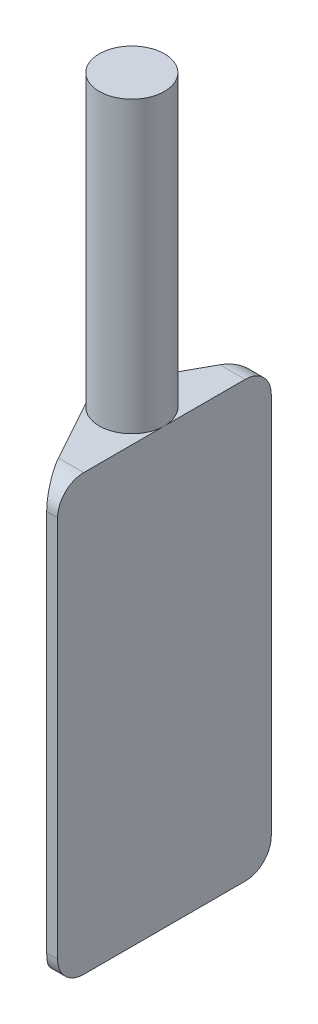
ISO-10303-21;
HEADER;
FILE_DESCRIPTION(('STEP AP214'),'2;1');
FILE_NAME('part.step','',(''),(''),'','','');
FILE_SCHEMA(('AUTOMOTIVE_DESIGN { 1 0 10303 214 1 1 1 1 }'));
ENDSEC;
DATA;
#1=APPLICATION_CONTEXT('core data for automotive mechanical design processes');
#2=APPLICATION_PROTOCOL_DEFINITION('international standard','automotive_design',2000,#1);
#3=PRODUCT_CONTEXT('',#1,'mechanical');
#4=PRODUCT('Part','Part','',(#3));
#5=PRODUCT_RELATED_PRODUCT_CATEGORY('part','',(#4));
#6=PRODUCT_DEFINITION_FORMATION('','',#4);
#7=PRODUCT_DEFINITION_CONTEXT('part definition',#1,'design');
#8=PRODUCT_DEFINITION('design','',#6,#7);
#9=PRODUCT_DEFINITION_SHAPE('','',#8);
#10=(LENGTH_UNIT() NAMED_UNIT(*) SI_UNIT(.MILLI.,.METRE.));
#11=(NAMED_UNIT(*) PLANE_ANGLE_UNIT() SI_UNIT($,.RADIAN.));
#12=(NAMED_UNIT(*) SI_UNIT($,.STERADIAN.) SOLID_ANGLE_UNIT());
#13=UNCERTAINTY_MEASURE_WITH_UNIT(LENGTH_MEASURE(1.E-05),#10,'distance_accuracy_value','');
#14=(GEOMETRIC_REPRESENTATION_CONTEXT(3) GLOBAL_UNCERTAINTY_ASSIGNED_CONTEXT((#13)) GLOBAL_UNIT_ASSIGNED_CONTEXT((#10,
#11,#12)) REPRESENTATION_CONTEXT('',''));
#15=CARTESIAN_POINT('',(0.,0.,0.));
#16=DIRECTION('',(0.,0.,1.));
#17=DIRECTION('',(1.,0.,0.));
#18=AXIS2_PLACEMENT_3D('',#15,#16,#17);
#19=CARTESIAN_POINT('',(0.,200.,0.));
#20=DIRECTION('',(0.,-1.,0.));
#21=DIRECTION('',(0.,0.,-1.));
#22=AXIS2_PLACEMENT_3D('',#19,#20,#21);
#23=CYLINDRICAL_SURFACE('',#22,9.);
#24=DIRECTION('',(0.,-1.,0.));
#25=VECTOR('',#24,1.);
#26=CARTESIAN_POINT('',(-7.87979284546265,120.,-4.34843244314495));
#27=LINE('',#26,#25);
#28=CARTESIAN_POINT('',(-7.87979284546265,120.,-4.34843244314494));
#29=VERTEX_POINT('',#28);
#30=CARTESIAN_POINT('',(-7.87979284546265,11.8061086205206,-4.34843244314495));
#31=VERTEX_POINT('',#30);
#32=EDGE_CURVE('E208',#29,#31,#27,.T.);
#33=ORIENTED_EDGE('',*,*,#32,.T.);
#34=CARTESIAN_POINT('',(0.,2.41533718804246,0.));
#35=DIRECTION('',(0.766044443118974,0.642787609686544,0.));
#36=DIRECTION('',(0.642787609686544,-0.766044443118974,0.));
#37=AXIS2_PLACEMENT_3D('',#34,#35,#36);
#38=ELLIPSE('',#37,14.0015144417436,9.);
#39=CARTESIAN_POINT('',(-7.87979284546265,11.8061086205206,4.34843244314495));
#40=VERTEX_POINT('',#39);
#41=EDGE_CURVE('E126',#31,#40,#38,.T.);
#42=ORIENTED_EDGE('',*,*,#41,.T.);
#43=DIRECTION('',(0.,-1.,0.));
#44=VECTOR('',#43,1.);
#45=CARTESIAN_POINT('',(-7.87979284546265,120.,4.34843244314495));
#46=LINE('',#45,#44);
#47=CARTESIAN_POINT('',(-7.87979284546265,120.,4.34843244314495));
#48=VERTEX_POINT('',#47);
#49=EDGE_CURVE('E226',#48,#40,#46,.T.);
#50=ORIENTED_EDGE('',*,*,#49,.F.);
#51=CARTESIAN_POINT('',(0.,120.,0.));
#52=DIRECTION('',(0.,-1.,0.));
#53=DIRECTION('',(0.,0.,-1.));
#54=AXIS2_PLACEMENT_3D('',#51,#52,#53);
#55=CIRCLE('',#54,9.);
#56=CARTESIAN_POINT('',(9.,120.,0.));
#57=VERTEX_POINT('',#56);
#58=EDGE_CURVE('E156',#57,#48,#55,.T.);
#59=ORIENTED_EDGE('',*,*,#58,.F.);
#60=EDGE_CURVE('E163',#29,#57,#55,.T.);
#61=ORIENTED_EDGE('',*,*,#60,.F.);
#62=EDGE_LOOP('',(#33,#42,#50,#59,#61));
#63=FACE_BOUND('',#62,.T.);
#64=CARTESIAN_POINT('',(0.,200.,0.));
#65=DIRECTION('',(0.,1.,0.));
#66=DIRECTION('',(0.,0.,1.));
#67=AXIS2_PLACEMENT_3D('',#64,#65,#66);
#68=CIRCLE('',#67,9.);
#69=CARTESIAN_POINT('',(0.,200.,9.));
#70=VERTEX_POINT('',#69);
#71=EDGE_CURVE('E237',#70,#70,#68,.T.);
#72=ORIENTED_EDGE('',*,*,#71,.F.);
#73=EDGE_LOOP('',(#72));
#74=FACE_BOUND('',#73,.T.);
#75=ADVANCED_FACE('F38',(#63,#74),#23,.T.);
#76=CARTESIAN_POINT('',(0.,200.,0.));
#77=DIRECTION('',(0.,1.,0.));
#78=DIRECTION('',(0.,0.,1.));
#79=AXIS2_PLACEMENT_3D('',#76,#77,#78);
#80=PLANE('',#79);
#81=ORIENTED_EDGE('',*,*,#71,.T.);
#82=EDGE_LOOP('',(#81));
#83=FACE_BOUND('',#82,.T.);
#84=ADVANCED_FACE('F249',(#83),#80,.T.);
#85=CARTESIAN_POINT('',(0.,0.,0.));
#86=DIRECTION('',(0.,1.,0.));
#87=DIRECTION('',(0.,0.,1.));
#88=AXIS2_PLACEMENT_3D('',#85,#86,#87);
#89=PLANE('',#88);
#90=DIRECTION('',(-1.,0.,0.));
#91=VECTOR('',#90,1.);
#92=CARTESIAN_POINT('',(6.,0.,22.3));
#93=LINE('',#92,#91);
#94=CARTESIAN_POINT('',(9.,0.,22.3));
#95=VERTEX_POINT('',#94);
#96=CARTESIAN_POINT('',(2.02670854365521,0.,22.3));
#97=VERTEX_POINT('',#96);
#98=EDGE_CURVE('E143',#95,#97,#93,.T.);
#99=ORIENTED_EDGE('',*,*,#98,.T.);
#100=DIRECTION('',(0.,0.,-1.));
#101=VECTOR('',#100,1.);
#102=CARTESIAN_POINT('',(2.02670854365521,0.,90.5));
#103=LINE('',#102,#101);
#104=CARTESIAN_POINT('',(2.02670854365521,0.,-22.3));
#105=VERTEX_POINT('',#104);
#106=EDGE_CURVE('E123',#97,#105,#103,.T.);
#107=ORIENTED_EDGE('',*,*,#106,.T.);
#108=DIRECTION('',(1.,0.,0.));
#109=VECTOR('',#108,1.);
#110=CARTESIAN_POINT('',(9.,0.,-22.3));
#111=LINE('',#110,#109);
#112=CARTESIAN_POINT('',(9.,0.,-22.3));
#113=VERTEX_POINT('',#112);
#114=EDGE_CURVE('E140',#105,#113,#111,.T.);
#115=ORIENTED_EDGE('',*,*,#114,.T.);
#116=DIRECTION('',(0.,0.,1.));
#117=VECTOR('',#116,1.);
#118=CARTESIAN_POINT('',(9.,0.,29.5));
#119=LINE('',#118,#117);
#120=EDGE_CURVE('E132',#113,#95,#119,.T.);
#121=ORIENTED_EDGE('',*,*,#120,.T.);
#122=EDGE_LOOP('',(#99,#107,#115,#121));
#123=FACE_BOUND('',#122,.T.);
#124=ADVANCED_FACE('F137',(#123),#89,.F.);
#125=CARTESIAN_POINT('',(0.,120.,0.));
#126=DIRECTION('',(0.,-1.,0.));
#127=DIRECTION('',(0.,0.,-1.));
#128=AXIS2_PLACEMENT_3D('',#125,#126,#127);
#129=PLANE('',#128);
#130=DIRECTION('',(-0.483159160349439,0.,-0.875532538384739));
#131=VECTOR('',#130,1.);
#132=CARTESIAN_POINT('',(6.,120.,29.5));
#133=LINE('',#132,#131);
#134=CARTESIAN_POINT('',(2.02670854365521,120.,22.3));
#135=VERTEX_POINT('',#134);
#136=EDGE_CURVE('E233',#135,#48,#133,.T.);
#137=ORIENTED_EDGE('',*,*,#136,.F.);
#138=DIRECTION('',(-1.,0.,0.));
#139=VECTOR('',#138,1.);
#140=CARTESIAN_POINT('',(9.,120.,22.3));
#141=LINE('',#140,#139);
#142=CARTESIAN_POINT('',(9.,120.,22.3));
#143=VERTEX_POINT('',#142);
#144=EDGE_CURVE('E190',#135,#143,#141,.F.);
#145=ORIENTED_EDGE('',*,*,#144,.T.);
#146=DIRECTION('',(0.,0.,1.));
#147=VECTOR('',#146,1.);
#148=CARTESIAN_POINT('',(9.,120.,29.5));
#149=LINE('',#148,#147);
#150=EDGE_CURVE('E221',#57,#143,#149,.T.);
#151=ORIENTED_EDGE('',*,*,#150,.F.);
#152=ORIENTED_EDGE('',*,*,#58,.T.);
#153=EDGE_LOOP('',(#137,#145,#151,#152));
#154=FACE_BOUND('',#153,.T.);
#155=ADVANCED_FACE('F281',(#154),#129,.F.);
#156=CARTESIAN_POINT('',(9.,120.,29.5));
#157=DIRECTION('',(1.,0.,0.));
#158=DIRECTION('',(0.,0.,-1.));
#159=AXIS2_PLACEMENT_3D('',#156,#157,#158);
#160=PLANE('',#159);
#161=DIRECTION('',(0.,-1.,0.));
#162=VECTOR('',#161,1.);
#163=CARTESIAN_POINT('',(9.,120.,29.5));
#164=LINE('',#163,#162);
#165=CARTESIAN_POINT('',(9.,112.8,29.5));
#166=VERTEX_POINT('',#165);
#167=CARTESIAN_POINT('',(9.,7.2,29.5));
#168=VERTEX_POINT('',#167);
#169=EDGE_CURVE('E234',#166,#168,#164,.T.);
#170=ORIENTED_EDGE('',*,*,#169,.T.);
#171=CARTESIAN_POINT('',(9.,7.2,22.3));
#172=DIRECTION('',(1.,0.,0.));
#173=DIRECTION('',(0.,0.,-1.));
#174=AXIS2_PLACEMENT_3D('',#171,#172,#173);
#175=CIRCLE('',#174,7.2);
#176=EDGE_CURVE('E187',#168,#95,#175,.T.);
#177=ORIENTED_EDGE('',*,*,#176,.T.);
#178=ORIENTED_EDGE('',*,*,#120,.F.);
#179=CARTESIAN_POINT('',(9.,7.2,-22.3));
#180=DIRECTION('',(1.,0.,0.));
#181=DIRECTION('',(0.,0.,-1.));
#182=AXIS2_PLACEMENT_3D('',#179,#180,#181);
#183=CIRCLE('',#182,7.2);
#184=CARTESIAN_POINT('',(9.,7.2,-29.5));
#185=VERTEX_POINT('',#184);
#186=EDGE_CURVE('E154',#113,#185,#183,.T.);
#187=ORIENTED_EDGE('',*,*,#186,.T.);
#188=DIRECTION('',(0.,-1.,0.));
#189=VECTOR('',#188,1.);
#190=CARTESIAN_POINT('',(9.,120.,-29.5));
#191=LINE('',#190,#189);
#192=CARTESIAN_POINT('',(9.,112.8,-29.5));
#193=VERTEX_POINT('',#192);
#194=EDGE_CURVE('E207',#193,#185,#191,.T.);
#195=ORIENTED_EDGE('',*,*,#194,.F.);
#196=CARTESIAN_POINT('',(9.,112.8,-22.3));
#197=DIRECTION('',(1.,0.,0.));
#198=DIRECTION('',(0.,0.,-1.));
#199=AXIS2_PLACEMENT_3D('',#196,#197,#198);
#200=CIRCLE('',#199,7.2);
#201=CARTESIAN_POINT('',(9.,120.,-22.3));
#202=VERTEX_POINT('',#201);
#203=EDGE_CURVE('E179',#193,#202,#200,.T.);
#204=ORIENTED_EDGE('',*,*,#203,.T.);
#205=EDGE_CURVE('E214',#202,#57,#149,.T.);
#206=ORIENTED_EDGE('',*,*,#205,.T.);
#207=ORIENTED_EDGE('',*,*,#150,.T.);
#208=CARTESIAN_POINT('',(9.,112.8,22.3));
#209=DIRECTION('',(1.,0.,0.));
#210=DIRECTION('',(0.,0.,-1.));
#211=AXIS2_PLACEMENT_3D('',#208,#209,#210);
#212=CIRCLE('',#211,7.2);
#213=EDGE_CURVE('E184',#143,#166,#212,.T.);
#214=ORIENTED_EDGE('',*,*,#213,.T.);
#215=EDGE_LOOP('',(#170,#177,#178,#187,#195,#204,#206,#207,#214));
#216=FACE_BOUND('',#215,.T.);
#217=ADVANCED_FACE('F212',(#216),#160,.T.);
#218=CARTESIAN_POINT('',(6.,120.,29.5));
#219=DIRECTION('',(0.,0.,1.));
#220=DIRECTION('',(1.,0.,0.));
#221=AXIS2_PLACEMENT_3D('',#218,#219,#220);
#222=PLANE('',#221);
#223=DIRECTION('',(0.,-1.,0.));
#224=VECTOR('',#223,1.);
#225=CARTESIAN_POINT('',(6.,120.,29.5));
#226=LINE('',#225,#224);
#227=CARTESIAN_POINT('',(6.,112.8,29.5));
#228=VERTEX_POINT('',#227);
#229=CARTESIAN_POINT('',(6.,7.2,29.5));
#230=VERTEX_POINT('',#229);
#231=EDGE_CURVE('E220',#228,#230,#226,.T.);
#232=ORIENTED_EDGE('',*,*,#231,.T.);
#233=DIRECTION('',(-1.,0.,0.));
#234=VECTOR('',#233,1.);
#235=CARTESIAN_POINT('',(9.,7.2,29.5));
#236=LINE('',#235,#234);
#237=EDGE_CURVE('E176',#230,#168,#236,.F.);
#238=ORIENTED_EDGE('',*,*,#237,.T.);
#239=ORIENTED_EDGE('',*,*,#169,.F.);
#240=DIRECTION('',(-1.,0.,0.));
#241=VECTOR('',#240,1.);
#242=CARTESIAN_POINT('',(6.,112.8,29.5));
#243=LINE('',#242,#241);
#244=EDGE_CURVE('E172',#166,#228,#243,.T.);
#245=ORIENTED_EDGE('',*,*,#244,.T.);
#246=EDGE_LOOP('',(#232,#238,#239,#245));
#247=FACE_BOUND('',#246,.T.);
#248=ADVANCED_FACE('F284',(#247),#222,.T.);
#249=CARTESIAN_POINT('',(6.,120.,-29.5));
#250=DIRECTION('',(0.,0.,-1.));
#251=DIRECTION('',(-1.,0.,0.));
#252=AXIS2_PLACEMENT_3D('',#249,#250,#251);
#253=PLANE('',#252);
#254=ORIENTED_EDGE('',*,*,#194,.T.);
#255=DIRECTION('',(1.,0.,0.));
#256=VECTOR('',#255,1.);
#257=CARTESIAN_POINT('',(6.,7.2,-29.5));
#258=LINE('',#257,#256);
#259=CARTESIAN_POINT('',(6.,7.2,-29.5));
#260=VERTEX_POINT('',#259);
#261=EDGE_CURVE('E60',#185,#260,#258,.F.);
#262=ORIENTED_EDGE('',*,*,#261,.T.);
#263=DIRECTION('',(0.,-1.,0.));
#264=VECTOR('',#263,1.);
#265=CARTESIAN_POINT('',(6.,120.,-29.5));
#266=LINE('',#265,#264);
#267=CARTESIAN_POINT('',(6.,112.8,-29.5));
#268=VERTEX_POINT('',#267);
#269=EDGE_CURVE('E149',#268,#260,#266,.T.);
#270=ORIENTED_EDGE('',*,*,#269,.F.);
#271=DIRECTION('',(1.,0.,0.));
#272=VECTOR('',#271,1.);
#273=CARTESIAN_POINT('',(9.,112.8,-29.5));
#274=LINE('',#273,#272);
#275=EDGE_CURVE('E193',#268,#193,#274,.T.);
#276=ORIENTED_EDGE('',*,*,#275,.T.);
#277=EDGE_LOOP('',(#254,#262,#270,#276));
#278=FACE_BOUND('',#277,.T.);
#279=ADVANCED_FACE('F204',(#278),#253,.T.);
#280=CARTESIAN_POINT('',(6.,120.,-29.5));
#281=DIRECTION('',(-0.87553253838474,0.,-0.483159160349439));
#282=DIRECTION('',(-0.483159160349439,0.,0.87553253838474));
#283=AXIS2_PLACEMENT_3D('',#280,#281,#282);
#284=PLANE('',#283);
#285=DIRECTION('',(0.418707690441328,-0.498996394330271,-0.758740053253206));
#286=VECTOR('',#285,1.);
#287=CARTESIAN_POINT('',(-20.0613745852783,26.3235524224258,17.7258073880701));
#288=LINE('',#287,#286);
#289=EDGE_CURVE('E120',#31,#105,#288,.T.);
#290=ORIENTED_EDGE('',*,*,#289,.F.);
#291=ORIENTED_EDGE('',*,*,#32,.F.);
#292=DIRECTION('',(0.483159160349439,0.,-0.875532538384739));
#293=VECTOR('',#292,1.);
#294=CARTESIAN_POINT('',(6.,120.,-29.5));
#295=LINE('',#294,#293);
#296=CARTESIAN_POINT('',(2.02670854365521,120.,-22.3));
#297=VERTEX_POINT('',#296);
#298=EDGE_CURVE('E201',#29,#297,#295,.T.);
#299=ORIENTED_EDGE('',*,*,#298,.T.);
#300=CARTESIAN_POINT('',(2.02670854365521,112.8,-22.3));
#301=DIRECTION('',(-0.87553253838474,0.,-0.483159160349439));
#302=DIRECTION('',(-0.483159160349439,0.,0.87553253838474));
#303=AXIS2_PLACEMENT_3D('',#300,#301,#302);
#304=ELLIPSE('',#303,8.22356644024127,7.2);
#305=EDGE_CURVE('E152',#297,#268,#304,.T.);
#306=ORIENTED_EDGE('',*,*,#305,.T.);
#307=ORIENTED_EDGE('',*,*,#269,.T.);
#308=CARTESIAN_POINT('',(2.02670854365521,7.2,-22.3));
#309=DIRECTION('',(-0.87553253838474,0.,-0.483159160349439));
#310=DIRECTION('',(-0.483159160349439,0.,0.87553253838474));
#311=AXIS2_PLACEMENT_3D('',#308,#309,#310);
#312=ELLIPSE('',#311,8.22356644024127,7.2);
#313=EDGE_CURVE('E47',#260,#105,#312,.T.);
#314=ORIENTED_EDGE('',*,*,#313,.T.);
#315=EDGE_LOOP('',(#290,#291,#299,#306,#307,#314));
#316=FACE_BOUND('',#315,.T.);
#317=ADVANCED_FACE('F148',(#316),#284,.T.);
#318=CARTESIAN_POINT('',(6.,120.,29.5));
#319=DIRECTION('',(-0.87553253838474,0.,0.483159160349439));
#320=DIRECTION('',(0.483159160349439,0.,0.87553253838474));
#321=AXIS2_PLACEMENT_3D('',#318,#319,#320);
#322=PLANE('',#321);
#323=DIRECTION('',(-0.418707690441328,0.498996394330271,-0.758740053253206));
#324=VECTOR('',#323,1.);
#325=CARTESIAN_POINT('',(-20.0613745852783,26.3235524224258,-17.7258073880701));
#326=LINE('',#325,#324);
#327=EDGE_CURVE('E145',#97,#40,#326,.T.);
#328=ORIENTED_EDGE('',*,*,#327,.F.);
#329=CARTESIAN_POINT('',(2.02670854365521,7.2,22.3));
#330=DIRECTION('',(-0.87553253838474,0.,0.483159160349439));
#331=DIRECTION('',(0.483159160349439,0.,0.87553253838474));
#332=AXIS2_PLACEMENT_3D('',#329,#330,#331);
#333=ELLIPSE('',#332,8.22356644024127,7.2);
#334=EDGE_CURVE('E169',#97,#230,#333,.T.);
#335=ORIENTED_EDGE('',*,*,#334,.T.);
#336=ORIENTED_EDGE('',*,*,#231,.F.);
#337=CARTESIAN_POINT('',(2.02670854365521,112.8,22.3));
#338=DIRECTION('',(-0.87553253838474,0.,0.483159160349439));
#339=DIRECTION('',(0.483159160349439,0.,0.87553253838474));
#340=AXIS2_PLACEMENT_3D('',#337,#338,#339);
#341=ELLIPSE('',#340,8.22356644024127,7.2);
#342=EDGE_CURVE('E160',#228,#135,#341,.T.);
#343=ORIENTED_EDGE('',*,*,#342,.T.);
#344=ORIENTED_EDGE('',*,*,#136,.T.);
#345=ORIENTED_EDGE('',*,*,#49,.T.);
#346=EDGE_LOOP('',(#328,#335,#336,#343,#344,#345));
#347=FACE_BOUND('',#346,.T.);
#348=ADVANCED_FACE('F280',(#347),#322,.T.);
#349=ORIENTED_EDGE('',*,*,#205,.F.);
#350=DIRECTION('',(1.,0.,0.));
#351=VECTOR('',#350,1.);
#352=CARTESIAN_POINT('',(6.,120.,-22.3));
#353=LINE('',#352,#351);
#354=EDGE_CURVE('E11',#202,#297,#353,.F.);
#355=ORIENTED_EDGE('',*,*,#354,.T.);
#356=ORIENTED_EDGE('',*,*,#298,.F.);
#357=ORIENTED_EDGE('',*,*,#60,.T.);
#358=EDGE_LOOP('',(#349,#355,#356,#357));
#359=FACE_BOUND('',#358,.T.);
#360=ADVANCED_FACE('F217',(#359),#129,.F.);
#361=CARTESIAN_POINT('',(0.,7.2,22.3));
#362=DIRECTION('',(1.,0.,0.));
#363=DIRECTION('',(0.,0.,-1.));
#364=AXIS2_PLACEMENT_3D('',#361,#362,#363);
#365=CYLINDRICAL_SURFACE('',#364,7.2);
#366=ORIENTED_EDGE('',*,*,#176,.F.);
#367=ORIENTED_EDGE('',*,*,#237,.F.);
#368=ORIENTED_EDGE('',*,*,#334,.F.);
#369=ORIENTED_EDGE('',*,*,#98,.F.);
#370=EDGE_LOOP('',(#366,#367,#368,#369));
#371=FACE_BOUND('',#370,.T.);
#372=ADVANCED_FACE('F260',(#371),#365,.T.);
#373=CARTESIAN_POINT('',(6.,112.8,22.3));
#374=DIRECTION('',(1.,0.,0.));
#375=DIRECTION('',(0.,0.,-1.));
#376=AXIS2_PLACEMENT_3D('',#373,#374,#375);
#377=CYLINDRICAL_SURFACE('',#376,7.2);
#378=ORIENTED_EDGE('',*,*,#213,.F.);
#379=ORIENTED_EDGE('',*,*,#144,.F.);
#380=ORIENTED_EDGE('',*,*,#342,.F.);
#381=ORIENTED_EDGE('',*,*,#244,.F.);
#382=EDGE_LOOP('',(#378,#379,#380,#381));
#383=FACE_BOUND('',#382,.T.);
#384=ADVANCED_FACE('F263',(#383),#377,.T.);
#385=CARTESIAN_POINT('',(0.,7.2,-22.3));
#386=DIRECTION('',(-1.,0.,0.));
#387=DIRECTION('',(0.,0.,1.));
#388=AXIS2_PLACEMENT_3D('',#385,#386,#387);
#389=CYLINDRICAL_SURFACE('',#388,7.2);
#390=ORIENTED_EDGE('',*,*,#313,.F.);
#391=ORIENTED_EDGE('',*,*,#261,.F.);
#392=ORIENTED_EDGE('',*,*,#186,.F.);
#393=ORIENTED_EDGE('',*,*,#114,.F.);
#394=EDGE_LOOP('',(#390,#391,#392,#393));
#395=FACE_BOUND('',#394,.T.);
#396=ADVANCED_FACE('F153',(#395),#389,.T.);
#397=CARTESIAN_POINT('',(6.,112.8,-22.3));
#398=DIRECTION('',(-1.,0.,0.));
#399=DIRECTION('',(0.,0.,1.));
#400=AXIS2_PLACEMENT_3D('',#397,#398,#399);
#401=CYLINDRICAL_SURFACE('',#400,7.2);
#402=ORIENTED_EDGE('',*,*,#305,.F.);
#403=ORIENTED_EDGE('',*,*,#354,.F.);
#404=ORIENTED_EDGE('',*,*,#203,.F.);
#405=ORIENTED_EDGE('',*,*,#275,.F.);
#406=EDGE_LOOP('',(#402,#403,#404,#405));
#407=FACE_BOUND('',#406,.T.);
#408=ADVANCED_FACE('F40',(#407),#401,.T.);
#409=CARTESIAN_POINT('',(2.02670854365521,0.,90.5));
#410=DIRECTION('',(0.766044443118974,0.642787609686544,0.));
#411=DIRECTION('',(-0.642787609686544,0.766044443118974,0.));
#412=AXIS2_PLACEMENT_3D('',#409,#410,#411);
#413=PLANE('',#412);
#414=ORIENTED_EDGE('',*,*,#289,.T.);
#415=ORIENTED_EDGE('',*,*,#106,.F.);
#416=ORIENTED_EDGE('',*,*,#327,.T.);
#417=ORIENTED_EDGE('',*,*,#41,.F.);
#418=EDGE_LOOP('',(#414,#415,#416,#417));
#419=FACE_BOUND('',#418,.T.);
#420=ADVANCED_FACE('F122',(#419),#413,.F.);
#421=CLOSED_SHELL('',(#75,#84,#124,#155,#217,#248,#279,#317,#348,#360,#372,#384,#396,#408,#420));
#422=MANIFOLD_SOLID_BREP('B2',#421);
#423=ADVANCED_BREP_SHAPE_REPRESENTATION('',(#18,#422),#14);
#424=SHAPE_DEFINITION_REPRESENTATION(#9,#423);
ENDSEC;
END-ISO-10303-21;
